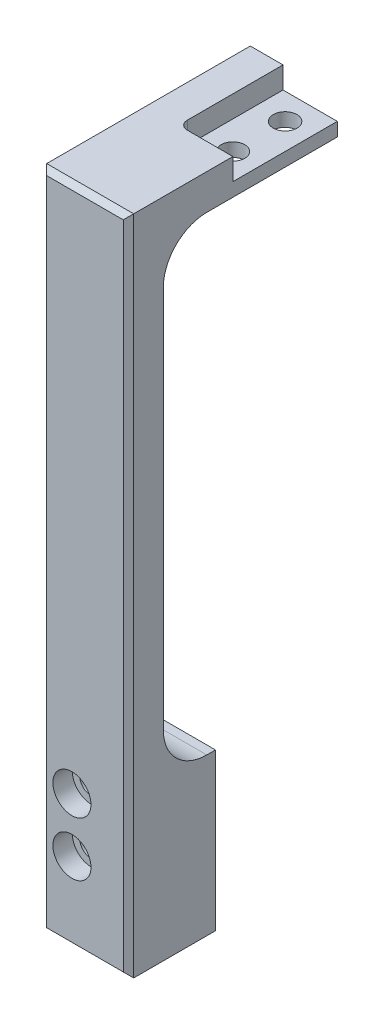
ISO-10303-21;
HEADER;
FILE_DESCRIPTION(('STEP AP214'),'2;1');
FILE_NAME('part.step','',(''),(''),'','','');
FILE_SCHEMA(('AUTOMOTIVE_DESIGN { 1 0 10303 214 1 1 1 1 }'));
ENDSEC;
DATA;
#1=APPLICATION_CONTEXT('core data for automotive mechanical design processes');
#2=APPLICATION_PROTOCOL_DEFINITION('international standard','automotive_design',2000,#1);
#3=PRODUCT_CONTEXT('',#1,'mechanical');
#4=PRODUCT('Part','Part','',(#3));
#5=PRODUCT_RELATED_PRODUCT_CATEGORY('part','',(#4));
#6=PRODUCT_DEFINITION_FORMATION('','',#4);
#7=PRODUCT_DEFINITION_CONTEXT('part definition',#1,'design');
#8=PRODUCT_DEFINITION('design','',#6,#7);
#9=PRODUCT_DEFINITION_SHAPE('','',#8);
#10=(LENGTH_UNIT() NAMED_UNIT(*) SI_UNIT(.MILLI.,.METRE.));
#11=(NAMED_UNIT(*) PLANE_ANGLE_UNIT() SI_UNIT($,.RADIAN.));
#12=(NAMED_UNIT(*) SI_UNIT($,.STERADIAN.) SOLID_ANGLE_UNIT());
#13=UNCERTAINTY_MEASURE_WITH_UNIT(LENGTH_MEASURE(1.E-05),#10,'distance_accuracy_value','');
#14=(GEOMETRIC_REPRESENTATION_CONTEXT(3) GLOBAL_UNCERTAINTY_ASSIGNED_CONTEXT((#13)) GLOBAL_UNIT_ASSIGNED_CONTEXT((#10,
#11,#12)) REPRESENTATION_CONTEXT('',''));
#15=CARTESIAN_POINT('',(0.,0.,0.));
#16=DIRECTION('',(0.,0.,1.));
#17=DIRECTION('',(1.,0.,0.));
#18=AXIS2_PLACEMENT_3D('',#15,#16,#17);
#19=CARTESIAN_POINT('',(8.89,0.,-13.97));
#20=DIRECTION('',(0.,1.,0.));
#21=DIRECTION('',(0.,0.,1.));
#22=AXIS2_PLACEMENT_3D('',#19,#20,#21);
#23=CYLINDRICAL_SURFACE('',#22,1.72719999999999);
#24=CARTESIAN_POINT('',(8.89,-5.1562,-13.97));
#25=DIRECTION('',(0.,1.,0.));
#26=DIRECTION('',(0.,0.,1.));
#27=AXIS2_PLACEMENT_3D('',#24,#25,#26);
#28=CIRCLE('',#27,1.72719999999999);
#29=CARTESIAN_POINT('',(8.89,-5.1562,-12.2428));
#30=VERTEX_POINT('',#29);
#31=EDGE_CURVE('E188',#30,#30,#28,.T.);
#32=ORIENTED_EDGE('',*,*,#31,.F.);
#33=EDGE_LOOP('',(#32));
#34=FACE_BOUND('',#33,.T.);
#35=CARTESIAN_POINT('',(8.89,-3.175,-13.97));
#36=DIRECTION('',(0.,1.,0.));
#37=DIRECTION('',(0.,0.,1.));
#38=AXIS2_PLACEMENT_3D('',#35,#36,#37);
#39=CIRCLE('',#38,1.72719999999999);
#40=CARTESIAN_POINT('',(8.89,-3.175,-12.2428));
#41=VERTEX_POINT('',#40);
#42=EDGE_CURVE('E184',#41,#41,#39,.F.);
#43=ORIENTED_EDGE('',*,*,#42,.F.);
#44=EDGE_LOOP('',(#43));
#45=FACE_BOUND('',#44,.T.);
#46=ADVANCED_FACE('F32',(#34,#45),#23,.F.);
#47=CARTESIAN_POINT('',(8.89,0.,-21.59));
#48=DIRECTION('',(0.,1.,0.));
#49=DIRECTION('',(0.,0.,1.));
#50=AXIS2_PLACEMENT_3D('',#47,#48,#49);
#51=CYLINDRICAL_SURFACE('',#50,1.72719999999999);
#52=CARTESIAN_POINT('',(8.89,-5.1562,-21.59));
#53=DIRECTION('',(0.,1.,0.));
#54=DIRECTION('',(0.,0.,1.));
#55=AXIS2_PLACEMENT_3D('',#52,#53,#54);
#56=CIRCLE('',#55,1.72719999999999);
#57=CARTESIAN_POINT('',(8.89,-5.1562,-19.8628));
#58=VERTEX_POINT('',#57);
#59=EDGE_CURVE('E187',#58,#58,#56,.T.);
#60=ORIENTED_EDGE('',*,*,#59,.F.);
#61=EDGE_LOOP('',(#60));
#62=FACE_BOUND('',#61,.T.);
#63=CARTESIAN_POINT('',(8.89,-3.175,-21.59));
#64=DIRECTION('',(0.,1.,0.));
#65=DIRECTION('',(0.,0.,1.));
#66=AXIS2_PLACEMENT_3D('',#63,#64,#65);
#67=CIRCLE('',#66,1.72719999999999);
#68=CARTESIAN_POINT('',(8.89,-3.175,-19.8628));
#69=VERTEX_POINT('',#68);
#70=EDGE_CURVE('E182',#69,#69,#67,.F.);
#71=ORIENTED_EDGE('',*,*,#70,.F.);
#72=EDGE_LOOP('',(#71));
#73=FACE_BOUND('',#72,.T.);
#74=ADVANCED_FACE('F380',(#62,#73),#51,.F.);
#75=CARTESIAN_POINT('',(0.,-96.5962,0.));
#76=DIRECTION('',(0.,0.,1.));
#77=DIRECTION('',(1.,0.,0.));
#78=AXIS2_PLACEMENT_3D('',#75,#76,#77);
#79=PLANE('',#78);
#80=DIRECTION('',(0.,1.,0.));
#81=VECTOR('',#80,1.);
#82=CARTESIAN_POINT('',(12.7,0.,0.));
#83=LINE('',#82,#81);
#84=CARTESIAN_POINT('',(12.7,-67.3862,0.));
#85=VERTEX_POINT('',#84);
#86=CARTESIAN_POINT('',(12.7,-11.5062,0.));
#87=VERTEX_POINT('',#86);
#88=EDGE_CURVE('E226',#85,#87,#83,.T.);
#89=ORIENTED_EDGE('',*,*,#88,.F.);
#90=DIRECTION('',(1.,0.,0.));
#91=VECTOR('',#90,1.);
#92=CARTESIAN_POINT('',(0.,-67.3862,0.));
#93=LINE('',#92,#91);
#94=CARTESIAN_POINT('',(0.,-67.3862,0.));
#95=VERTEX_POINT('',#94);
#96=EDGE_CURVE('E235',#85,#95,#93,.F.);
#97=ORIENTED_EDGE('',*,*,#96,.T.);
#98=DIRECTION('',(0.,-1.,0.));
#99=VECTOR('',#98,1.);
#100=CARTESIAN_POINT('',(0.,0.,0.));
#101=LINE('',#100,#99);
#102=CARTESIAN_POINT('',(0.,-11.5062,0.));
#103=VERTEX_POINT('',#102);
#104=EDGE_CURVE('E222',#103,#95,#101,.T.);
#105=ORIENTED_EDGE('',*,*,#104,.F.);
#106=DIRECTION('',(-1.,0.,0.));
#107=VECTOR('',#106,1.);
#108=CARTESIAN_POINT('',(12.7,-11.5062,0.));
#109=LINE('',#108,#107);
#110=EDGE_CURVE('E233',#103,#87,#109,.F.);
#111=ORIENTED_EDGE('',*,*,#110,.T.);
#112=EDGE_LOOP('',(#89,#97,#105,#111));
#113=FACE_BOUND('',#112,.T.);
#114=ADVANCED_FACE('F338',(#113),#79,.F.);
#115=CARTESIAN_POINT('',(0.,0.,5.08));
#116=DIRECTION('',(1.,0.,0.));
#117=DIRECTION('',(0.,1.,0.));
#118=AXIS2_PLACEMENT_3D('',#115,#116,#117);
#119=PLANE('',#118);
#120=DIRECTION('',(0.,0.,-1.));
#121=VECTOR('',#120,1.);
#122=CARTESIAN_POINT('',(0.,-96.5962,5.08));
#123=LINE('',#122,#121);
#124=CARTESIAN_POINT('',(0.,-96.5962,4.318));
#125=VERTEX_POINT('',#124);
#126=CARTESIAN_POINT('',(0.,-96.5962,-7.62));
#127=VERTEX_POINT('',#126);
#128=EDGE_CURVE('E297',#125,#127,#123,.T.);
#129=ORIENTED_EDGE('',*,*,#128,.F.);
#130=DIRECTION('',(0.,1.,0.));
#131=VECTOR('',#130,1.);
#132=CARTESIAN_POINT('',(0.,0.,4.318));
#133=LINE('',#132,#131);
#134=CARTESIAN_POINT('',(0.,0.,4.318));
#135=VERTEX_POINT('',#134);
#136=EDGE_CURVE('E257',#125,#135,#133,.T.);
#137=ORIENTED_EDGE('',*,*,#136,.T.);
#138=DIRECTION('',(0.,0.,-1.));
#139=VECTOR('',#138,1.);
#140=CARTESIAN_POINT('',(0.,0.,5.08));
#141=LINE('',#140,#139);
#142=CARTESIAN_POINT('',(0.,0.,-25.4));
#143=VERTEX_POINT('',#142);
#144=EDGE_CURVE('E232',#135,#143,#141,.T.);
#145=ORIENTED_EDGE('',*,*,#144,.T.);
#146=DIRECTION('',(0.,1.,0.));
#147=VECTOR('',#146,1.);
#148=CARTESIAN_POINT('',(0.,0.,-25.4));
#149=LINE('',#148,#147);
#150=CARTESIAN_POINT('',(0.,-5.1562,-25.4));
#151=VERTEX_POINT('',#150);
#152=EDGE_CURVE('E210',#151,#143,#149,.T.);
#153=ORIENTED_EDGE('',*,*,#152,.F.);
#154=DIRECTION('',(0.,0.,1.));
#155=VECTOR('',#154,1.);
#156=CARTESIAN_POINT('',(0.,-5.1562,-25.4));
#157=LINE('',#156,#155);
#158=CARTESIAN_POINT('',(0.,-5.1562,-6.35));
#159=VERTEX_POINT('',#158);
#160=EDGE_CURVE('E216',#151,#159,#157,.T.);
#161=ORIENTED_EDGE('',*,*,#160,.T.);
#162=CARTESIAN_POINT('',(0.,-11.5062,-6.35));
#163=DIRECTION('',(1.,0.,0.));
#164=DIRECTION('',(0.,1.,0.));
#165=AXIS2_PLACEMENT_3D('',#162,#163,#164);
#166=CIRCLE('',#165,6.35);
#167=EDGE_CURVE('E244',#159,#103,#166,.T.);
#168=ORIENTED_EDGE('',*,*,#167,.T.);
#169=ORIENTED_EDGE('',*,*,#104,.T.);
#170=CARTESIAN_POINT('',(0.,-67.3862,-6.35));
#171=DIRECTION('',(1.,0.,0.));
#172=DIRECTION('',(0.,1.,0.));
#173=AXIS2_PLACEMENT_3D('',#170,#171,#172);
#174=CIRCLE('',#173,6.35);
#175=CARTESIAN_POINT('',(0.,-73.7362,-6.35));
#176=VERTEX_POINT('',#175);
#177=EDGE_CURVE('E242',#95,#176,#174,.T.);
#178=ORIENTED_EDGE('',*,*,#177,.T.);
#179=DIRECTION('',(0.,0.,1.));
#180=VECTOR('',#179,1.);
#181=CARTESIAN_POINT('',(0.,-73.7362,-7.62));
#182=LINE('',#181,#180);
#183=CARTESIAN_POINT('',(0.,-73.7362,-7.62));
#184=VERTEX_POINT('',#183);
#185=EDGE_CURVE('E204',#184,#176,#182,.T.);
#186=ORIENTED_EDGE('',*,*,#185,.F.);
#187=DIRECTION('',(0.,1.,0.));
#188=VECTOR('',#187,1.);
#189=CARTESIAN_POINT('',(0.,-96.5962,-7.62));
#190=LINE('',#189,#188);
#191=EDGE_CURVE('E197',#127,#184,#190,.T.);
#192=ORIENTED_EDGE('',*,*,#191,.F.);
#193=EDGE_LOOP('',(#129,#137,#145,#153,#161,#168,#169,#178,#186,#192));
#194=FACE_BOUND('',#193,.T.);
#195=ADVANCED_FACE('F317',(#194),#119,.F.);
#196=CARTESIAN_POINT('',(0.,-96.5962,5.08));
#197=DIRECTION('',(0.,1.,0.));
#198=DIRECTION('',(0.,0.,1.));
#199=AXIS2_PLACEMENT_3D('',#196,#197,#198);
#200=PLANE('',#199);
#201=DIRECTION('',(0.,0.,-1.));
#202=VECTOR('',#201,1.);
#203=CARTESIAN_POINT('',(12.7,-96.5962,5.08));
#204=LINE('',#203,#202);
#205=CARTESIAN_POINT('',(12.7,-96.5962,4.318));
#206=VERTEX_POINT('',#205);
#207=CARTESIAN_POINT('',(12.7,-96.5962,-7.62));
#208=VERTEX_POINT('',#207);
#209=EDGE_CURVE('E311',#206,#208,#204,.T.);
#210=ORIENTED_EDGE('',*,*,#209,.F.);
#211=DIRECTION('',(-1.,0.,0.));
#212=VECTOR('',#211,1.);
#213=CARTESIAN_POINT('',(0.,-96.5962,4.318));
#214=LINE('',#213,#212);
#215=EDGE_CURVE('E260',#206,#125,#214,.T.);
#216=ORIENTED_EDGE('',*,*,#215,.T.);
#217=ORIENTED_EDGE('',*,*,#128,.T.);
#218=DIRECTION('',(-1.,0.,0.));
#219=VECTOR('',#218,1.);
#220=CARTESIAN_POINT('',(12.7,-96.5962,-7.62));
#221=LINE('',#220,#219);
#222=EDGE_CURVE('E194',#208,#127,#221,.T.);
#223=ORIENTED_EDGE('',*,*,#222,.F.);
#224=EDGE_LOOP('',(#210,#216,#217,#223));
#225=FACE_BOUND('',#224,.T.);
#226=ADVANCED_FACE('F411',(#225),#200,.F.);
#227=CARTESIAN_POINT('',(12.7,0.,5.08));
#228=DIRECTION('',(-1.,0.,0.));
#229=DIRECTION('',(0.,-1.,0.));
#230=AXIS2_PLACEMENT_3D('',#227,#228,#229);
#231=PLANE('',#230);
#232=DIRECTION('',(0.,0.,-1.));
#233=VECTOR('',#232,1.);
#234=CARTESIAN_POINT('',(12.7,0.,5.08));
#235=LINE('',#234,#233);
#236=CARTESIAN_POINT('',(12.7,0.,4.318));
#237=VERTEX_POINT('',#236);
#238=CARTESIAN_POINT('',(12.7,0.,-10.16));
#239=VERTEX_POINT('',#238);
#240=EDGE_CURVE('E313',#237,#239,#235,.T.);
#241=ORIENTED_EDGE('',*,*,#240,.F.);
#242=DIRECTION('',(0.,-1.,0.));
#243=VECTOR('',#242,1.);
#244=CARTESIAN_POINT('',(12.7,-96.5962,4.318));
#245=LINE('',#244,#243);
#246=EDGE_CURVE('E41',#237,#206,#245,.T.);
#247=ORIENTED_EDGE('',*,*,#246,.T.);
#248=ORIENTED_EDGE('',*,*,#209,.T.);
#249=DIRECTION('',(0.,-1.,0.));
#250=VECTOR('',#249,1.);
#251=CARTESIAN_POINT('',(12.7,-96.5962,-7.62));
#252=LINE('',#251,#250);
#253=CARTESIAN_POINT('',(12.7,-73.7362,-7.62));
#254=VERTEX_POINT('',#253);
#255=EDGE_CURVE('E191',#254,#208,#252,.T.);
#256=ORIENTED_EDGE('',*,*,#255,.F.);
#257=DIRECTION('',(0.,0.,1.));
#258=VECTOR('',#257,1.);
#259=CARTESIAN_POINT('',(12.7,-73.7362,-7.62));
#260=LINE('',#259,#258);
#261=CARTESIAN_POINT('',(12.7,-73.7362,-6.35));
#262=VERTEX_POINT('',#261);
#263=EDGE_CURVE('E201',#254,#262,#260,.T.);
#264=ORIENTED_EDGE('',*,*,#263,.T.);
#265=CARTESIAN_POINT('',(12.7,-67.3862,-6.35));
#266=DIRECTION('',(-1.,0.,0.));
#267=DIRECTION('',(0.,-1.,0.));
#268=AXIS2_PLACEMENT_3D('',#265,#266,#267);
#269=CIRCLE('',#268,6.35);
#270=EDGE_CURVE('E240',#262,#85,#269,.T.);
#271=ORIENTED_EDGE('',*,*,#270,.T.);
#272=ORIENTED_EDGE('',*,*,#88,.T.);
#273=CARTESIAN_POINT('',(12.7,-11.5062,-6.35));
#274=DIRECTION('',(-1.,0.,0.));
#275=DIRECTION('',(0.,-1.,0.));
#276=AXIS2_PLACEMENT_3D('',#273,#274,#275);
#277=CIRCLE('',#276,6.35);
#278=CARTESIAN_POINT('',(12.7,-5.1562,-6.35));
#279=VERTEX_POINT('',#278);
#280=EDGE_CURVE('E246',#87,#279,#277,.T.);
#281=ORIENTED_EDGE('',*,*,#280,.T.);
#282=DIRECTION('',(0.,0.,1.));
#283=VECTOR('',#282,1.);
#284=CARTESIAN_POINT('',(12.7,-5.1562,-25.4));
#285=LINE('',#284,#283);
#286=CARTESIAN_POINT('',(12.7,-5.1562,-25.4));
#287=VERTEX_POINT('',#286);
#288=EDGE_CURVE('E227',#287,#279,#285,.T.);
#289=ORIENTED_EDGE('',*,*,#288,.F.);
#290=DIRECTION('',(0.,-1.,0.));
#291=VECTOR('',#290,1.);
#292=CARTESIAN_POINT('',(12.7,0.,-25.4));
#293=LINE('',#292,#291);
#294=CARTESIAN_POINT('',(12.7,-3.175,-25.4));
#295=VERTEX_POINT('',#294);
#296=EDGE_CURVE('E172',#295,#287,#293,.T.);
#297=ORIENTED_EDGE('',*,*,#296,.F.);
#298=DIRECTION('',(0.,0.,-1.));
#299=VECTOR('',#298,1.);
#300=CARTESIAN_POINT('',(12.7,-3.175,-25.4));
#301=LINE('',#300,#299);
#302=CARTESIAN_POINT('',(12.7,-3.175,-10.16));
#303=VERTEX_POINT('',#302);
#304=EDGE_CURVE('E151',#303,#295,#301,.T.);
#305=ORIENTED_EDGE('',*,*,#304,.F.);
#306=DIRECTION('',(0.,1.,0.));
#307=VECTOR('',#306,1.);
#308=CARTESIAN_POINT('',(12.7,-3.175,-10.16));
#309=LINE('',#308,#307);
#310=EDGE_CURVE('E162',#303,#239,#309,.T.);
#311=ORIENTED_EDGE('',*,*,#310,.T.);
#312=EDGE_LOOP('',(#241,#247,#248,#256,#264,#271,#272,#281,#289,#297,#305,#311));
#313=FACE_BOUND('',#312,.T.);
#314=ADVANCED_FACE('F170',(#313),#231,.F.);
#315=CARTESIAN_POINT('',(0.,0.,5.08));
#316=DIRECTION('',(0.,-1.,0.));
#317=DIRECTION('',(0.,0.,-1.));
#318=AXIS2_PLACEMENT_3D('',#315,#316,#317);
#319=PLANE('',#318);
#320=ORIENTED_EDGE('',*,*,#144,.F.);
#321=DIRECTION('',(1.,0.,0.));
#322=VECTOR('',#321,1.);
#323=CARTESIAN_POINT('',(12.7,0.,4.318));
#324=LINE('',#323,#322);
#325=EDGE_CURVE('E11',#135,#237,#324,.T.);
#326=ORIENTED_EDGE('',*,*,#325,.T.);
#327=ORIENTED_EDGE('',*,*,#240,.T.);
#328=DIRECTION('',(1.,0.,0.));
#329=VECTOR('',#328,1.);
#330=CARTESIAN_POINT('',(4.7752,0.,-10.16));
#331=LINE('',#330,#329);
#332=CARTESIAN_POINT('',(6.0452,0.,-10.16));
#333=VERTEX_POINT('',#332);
#334=EDGE_CURVE('E165',#333,#239,#331,.T.);
#335=ORIENTED_EDGE('',*,*,#334,.F.);
#336=CARTESIAN_POINT('',(6.0452,0.,-11.43));
#337=DIRECTION('',(0.,-1.,0.));
#338=DIRECTION('',(0.,0.,-1.));
#339=AXIS2_PLACEMENT_3D('',#336,#337,#338);
#340=CIRCLE('',#339,1.27);
#341=CARTESIAN_POINT('',(4.7752,0.,-11.43));
#342=VERTEX_POINT('',#341);
#343=EDGE_CURVE('E292',#333,#342,#340,.T.);
#344=ORIENTED_EDGE('',*,*,#343,.T.);
#345=DIRECTION('',(0.,0.,1.));
#346=VECTOR('',#345,1.);
#347=CARTESIAN_POINT('',(4.7752,0.,-25.4));
#348=LINE('',#347,#346);
#349=CARTESIAN_POINT('',(4.7752,0.,-25.4));
#350=VERTEX_POINT('',#349);
#351=EDGE_CURVE('E177',#350,#342,#348,.T.);
#352=ORIENTED_EDGE('',*,*,#351,.F.);
#353=DIRECTION('',(1.,0.,0.));
#354=VECTOR('',#353,1.);
#355=CARTESIAN_POINT('',(12.7,0.,-25.4));
#356=LINE('',#355,#354);
#357=EDGE_CURVE('E213',#143,#350,#356,.T.);
#358=ORIENTED_EDGE('',*,*,#357,.F.);
#359=EDGE_LOOP('',(#320,#326,#327,#335,#344,#352,#358));
#360=FACE_BOUND('',#359,.T.);
#361=ADVANCED_FACE('F325',(#360),#319,.F.);
#362=CARTESIAN_POINT('',(0.,-96.5962,5.08));
#363=DIRECTION('',(0.,0.,1.));
#364=DIRECTION('',(1.,0.,0.));
#365=AXIS2_PLACEMENT_3D('',#362,#363,#364);
#366=PLANE('',#365);
#367=CARTESIAN_POINT('',(4.44500000000003,-84.963,5.08));
#368=DIRECTION('',(0.,0.,1.));
#369=DIRECTION('',(1.,0.,0.));
#370=AXIS2_PLACEMENT_3D('',#367,#368,#369);
#371=CIRCLE('',#370,2.77875999999999);
#372=CARTESIAN_POINT('',(7.22376000000003,-84.963,5.08));
#373=VERTEX_POINT('',#372);
#374=EDGE_CURVE('E642',#373,#373,#371,.T.);
#375=ORIENTED_EDGE('',*,*,#374,.F.);
#376=EDGE_LOOP('',(#375));
#377=FACE_BOUND('',#376,.T.);
#378=CARTESIAN_POINT('',(4.44500000000003,-77.0382,5.08));
#379=DIRECTION('',(0.,0.,1.));
#380=DIRECTION('',(1.,0.,0.));
#381=AXIS2_PLACEMENT_3D('',#378,#379,#380);
#382=CIRCLE('',#381,2.77875999999999);
#383=CARTESIAN_POINT('',(7.22376000000003,-77.0382,5.08));
#384=VERTEX_POINT('',#383);
#385=EDGE_CURVE('E282',#384,#384,#382,.T.);
#386=ORIENTED_EDGE('',*,*,#385,.F.);
#387=EDGE_LOOP('',(#386));
#388=FACE_BOUND('',#387,.T.);
#389=DIRECTION('',(-1.,0.,0.));
#390=VECTOR('',#389,1.);
#391=CARTESIAN_POINT('',(0.,-0.761999999999999,5.08));
#392=LINE('',#391,#390);
#393=CARTESIAN_POINT('',(11.938,-0.761999999999999,5.08));
#394=VERTEX_POINT('',#393);
#395=CARTESIAN_POINT('',(0.761999999999999,-0.761999999999999,5.08));
#396=VERTEX_POINT('',#395);
#397=EDGE_CURVE('E248',#394,#396,#392,.T.);
#398=ORIENTED_EDGE('',*,*,#397,.T.);
#399=DIRECTION('',(0.,-1.,0.));
#400=VECTOR('',#399,1.);
#401=CARTESIAN_POINT('',(0.762000000000011,-96.5962,5.08));
#402=LINE('',#401,#400);
#403=CARTESIAN_POINT('',(0.76200000000001,-95.8342,5.08));
#404=VERTEX_POINT('',#403);
#405=EDGE_CURVE('E254',#396,#404,#402,.T.);
#406=ORIENTED_EDGE('',*,*,#405,.T.);
#407=DIRECTION('',(1.,0.,0.));
#408=VECTOR('',#407,1.);
#409=CARTESIAN_POINT('',(12.7,-95.8342,5.08));
#410=LINE('',#409,#408);
#411=CARTESIAN_POINT('',(11.938,-95.8342,5.08));
#412=VERTEX_POINT('',#411);
#413=EDGE_CURVE('E252',#404,#412,#410,.T.);
#414=ORIENTED_EDGE('',*,*,#413,.T.);
#415=DIRECTION('',(0.,1.,0.));
#416=VECTOR('',#415,1.);
#417=CARTESIAN_POINT('',(11.938,0.,5.08));
#418=LINE('',#417,#416);
#419=EDGE_CURVE('E250',#412,#394,#418,.T.);
#420=ORIENTED_EDGE('',*,*,#419,.T.);
#421=EDGE_LOOP('',(#398,#406,#414,#420));
#422=FACE_BOUND('',#421,.T.);
#423=ADVANCED_FACE('F367',(#377,#388,#422),#366,.T.);
#424=CARTESIAN_POINT('',(12.7,-5.1562,-25.4));
#425=DIRECTION('',(0.,1.,0.));
#426=DIRECTION('',(0.,0.,1.));
#427=AXIS2_PLACEMENT_3D('',#424,#425,#426);
#428=PLANE('',#427);
#429=ORIENTED_EDGE('',*,*,#59,.T.);
#430=EDGE_LOOP('',(#429));
#431=FACE_BOUND('',#430,.T.);
#432=ORIENTED_EDGE('',*,*,#31,.T.);
#433=EDGE_LOOP('',(#432));
#434=FACE_BOUND('',#433,.T.);
#435=ORIENTED_EDGE('',*,*,#288,.T.);
#436=DIRECTION('',(-1.,0.,0.));
#437=VECTOR('',#436,1.);
#438=CARTESIAN_POINT('',(0.,-5.1562,-6.35));
#439=LINE('',#438,#437);
#440=EDGE_CURVE('E237',#279,#159,#439,.T.);
#441=ORIENTED_EDGE('',*,*,#440,.T.);
#442=ORIENTED_EDGE('',*,*,#160,.F.);
#443=DIRECTION('',(-1.,0.,0.));
#444=VECTOR('',#443,1.);
#445=CARTESIAN_POINT('',(12.7,-5.1562,-25.4));
#446=LINE('',#445,#444);
#447=EDGE_CURVE('E208',#287,#151,#446,.T.);
#448=ORIENTED_EDGE('',*,*,#447,.F.);
#449=EDGE_LOOP('',(#435,#441,#442,#448));
#450=FACE_BOUND('',#449,.T.);
#451=ADVANCED_FACE('F328',(#431,#434,#450),#428,.F.);
#452=CARTESIAN_POINT('',(12.7,-5.1562,-25.4));
#453=DIRECTION('',(0.,0.,-1.));
#454=DIRECTION('',(-1.,0.,0.));
#455=AXIS2_PLACEMENT_3D('',#452,#453,#454);
#456=PLANE('',#455);
#457=DIRECTION('',(0.,1.,0.));
#458=VECTOR('',#457,1.);
#459=CARTESIAN_POINT('',(4.7752,-3.175,-25.4));
#460=LINE('',#459,#458);
#461=CARTESIAN_POINT('',(4.7752,-3.175,-25.4));
#462=VERTEX_POINT('',#461);
#463=EDGE_CURVE('E166',#462,#350,#460,.T.);
#464=ORIENTED_EDGE('',*,*,#463,.F.);
#465=DIRECTION('',(-1.,0.,0.));
#466=VECTOR('',#465,1.);
#467=CARTESIAN_POINT('',(4.7752,-3.175,-25.4));
#468=LINE('',#467,#466);
#469=EDGE_CURVE('E167',#295,#462,#468,.T.);
#470=ORIENTED_EDGE('',*,*,#469,.F.);
#471=ORIENTED_EDGE('',*,*,#296,.T.);
#472=ORIENTED_EDGE('',*,*,#447,.T.);
#473=ORIENTED_EDGE('',*,*,#152,.T.);
#474=ORIENTED_EDGE('',*,*,#357,.T.);
#475=EDGE_LOOP('',(#464,#470,#471,#472,#473,#474));
#476=FACE_BOUND('',#475,.T.);
#477=ADVANCED_FACE('F321',(#476),#456,.T.);
#478=CARTESIAN_POINT('',(12.7,-73.7362,-7.62));
#479=DIRECTION('',(0.,-1.,0.));
#480=DIRECTION('',(0.,0.,-1.));
#481=AXIS2_PLACEMENT_3D('',#478,#479,#480);
#482=PLANE('',#481);
#483=ORIENTED_EDGE('',*,*,#185,.T.);
#484=DIRECTION('',(1.,0.,0.));
#485=VECTOR('',#484,1.);
#486=CARTESIAN_POINT('',(12.7,-73.7362,-6.35));
#487=LINE('',#486,#485);
#488=EDGE_CURVE('E228',#176,#262,#487,.T.);
#489=ORIENTED_EDGE('',*,*,#488,.T.);
#490=ORIENTED_EDGE('',*,*,#263,.F.);
#491=DIRECTION('',(1.,0.,0.));
#492=VECTOR('',#491,1.);
#493=CARTESIAN_POINT('',(12.7,-73.7362,-7.62));
#494=LINE('',#493,#492);
#495=EDGE_CURVE('E199',#184,#254,#494,.T.);
#496=ORIENTED_EDGE('',*,*,#495,.F.);
#497=EDGE_LOOP('',(#483,#489,#490,#496));
#498=FACE_BOUND('',#497,.T.);
#499=ADVANCED_FACE('F348',(#498),#482,.F.);
#500=CARTESIAN_POINT('',(12.7,-73.7362,-7.62));
#501=DIRECTION('',(0.,0.,1.));
#502=DIRECTION('',(1.,0.,0.));
#503=AXIS2_PLACEMENT_3D('',#500,#501,#502);
#504=PLANE('',#503);
#505=CARTESIAN_POINT('',(4.44500000000003,-84.963,-7.62));
#506=DIRECTION('',(0.,0.,1.));
#507=DIRECTION('',(1.,0.,0.));
#508=AXIS2_PLACEMENT_3D('',#505,#506,#507);
#509=CIRCLE('',#508,1.7272);
#510=CARTESIAN_POINT('',(6.17220000000003,-84.963,-7.62));
#511=VERTEX_POINT('',#510);
#512=EDGE_CURVE('E36',#511,#511,#509,.T.);
#513=ORIENTED_EDGE('',*,*,#512,.T.);
#514=EDGE_LOOP('',(#513));
#515=FACE_BOUND('',#514,.T.);
#516=CARTESIAN_POINT('',(4.44500000000003,-77.0382,-7.62));
#517=DIRECTION('',(0.,0.,1.));
#518=DIRECTION('',(1.,0.,0.));
#519=AXIS2_PLACEMENT_3D('',#516,#517,#518);
#520=CIRCLE('',#519,1.7272);
#521=CARTESIAN_POINT('',(6.17220000000003,-77.0382,-7.62));
#522=VERTEX_POINT('',#521);
#523=EDGE_CURVE('E266',#522,#522,#520,.T.);
#524=ORIENTED_EDGE('',*,*,#523,.T.);
#525=EDGE_LOOP('',(#524));
#526=FACE_BOUND('',#525,.T.);
#527=ORIENTED_EDGE('',*,*,#255,.T.);
#528=ORIENTED_EDGE('',*,*,#222,.T.);
#529=ORIENTED_EDGE('',*,*,#191,.T.);
#530=ORIENTED_EDGE('',*,*,#495,.T.);
#531=EDGE_LOOP('',(#527,#528,#529,#530));
#532=FACE_BOUND('',#531,.T.);
#533=ADVANCED_FACE('F352',(#515,#526,#532),#504,.F.);
#534=CARTESIAN_POINT('',(4.7752,-3.175,-10.16));
#535=DIRECTION('',(0.,1.,0.));
#536=DIRECTION('',(0.,0.,1.));
#537=AXIS2_PLACEMENT_3D('',#534,#535,#536);
#538=PLANE('',#537);
#539=ORIENTED_EDGE('',*,*,#70,.T.);
#540=EDGE_LOOP('',(#539));
#541=FACE_BOUND('',#540,.T.);
#542=DIRECTION('',(0.,0.,1.));
#543=VECTOR('',#542,1.);
#544=CARTESIAN_POINT('',(4.7752,-3.175,-25.4));
#545=LINE('',#544,#543);
#546=CARTESIAN_POINT('',(4.7752,-3.175,-11.43));
#547=VERTEX_POINT('',#546);
#548=EDGE_CURVE('E158',#462,#547,#545,.T.);
#549=ORIENTED_EDGE('',*,*,#548,.T.);
#550=CARTESIAN_POINT('',(6.0452,-3.175,-11.43));
#551=DIRECTION('',(0.,1.,0.));
#552=DIRECTION('',(0.,0.,1.));
#553=AXIS2_PLACEMENT_3D('',#550,#551,#552);
#554=CIRCLE('',#553,1.27);
#555=CARTESIAN_POINT('',(6.0452,-3.175,-10.16));
#556=VERTEX_POINT('',#555);
#557=EDGE_CURVE('E154',#547,#556,#554,.T.);
#558=ORIENTED_EDGE('',*,*,#557,.T.);
#559=DIRECTION('',(1.,0.,0.));
#560=VECTOR('',#559,1.);
#561=CARTESIAN_POINT('',(4.7752,-3.175,-10.16));
#562=LINE('',#561,#560);
#563=EDGE_CURVE('E144',#556,#303,#562,.T.);
#564=ORIENTED_EDGE('',*,*,#563,.T.);
#565=ORIENTED_EDGE('',*,*,#304,.T.);
#566=ORIENTED_EDGE('',*,*,#469,.T.);
#567=EDGE_LOOP('',(#549,#558,#564,#565,#566));
#568=FACE_BOUND('',#567,.T.);
#569=ORIENTED_EDGE('',*,*,#42,.T.);
#570=EDGE_LOOP('',(#569));
#571=FACE_BOUND('',#570,.T.);
#572=ADVANCED_FACE('F147',(#541,#568,#571),#538,.T.);
#573=CARTESIAN_POINT('',(4.7752,-3.175,-25.4));
#574=DIRECTION('',(-1.,0.,0.));
#575=DIRECTION('',(0.,0.,1.));
#576=AXIS2_PLACEMENT_3D('',#573,#574,#575);
#577=PLANE('',#576);
#578=ORIENTED_EDGE('',*,*,#351,.T.);
#579=DIRECTION('',(0.,1.,0.));
#580=VECTOR('',#579,1.);
#581=CARTESIAN_POINT('',(4.7752,-3.175,-11.43));
#582=LINE('',#581,#580);
#583=EDGE_CURVE('E290',#342,#547,#582,.F.);
#584=ORIENTED_EDGE('',*,*,#583,.T.);
#585=ORIENTED_EDGE('',*,*,#548,.F.);
#586=ORIENTED_EDGE('',*,*,#463,.T.);
#587=EDGE_LOOP('',(#578,#584,#585,#586));
#588=FACE_BOUND('',#587,.T.);
#589=ADVANCED_FACE('F326',(#588),#577,.F.);
#590=CARTESIAN_POINT('',(4.7752,-3.175,-10.16));
#591=DIRECTION('',(0.,0.,1.));
#592=DIRECTION('',(1.,0.,0.));
#593=AXIS2_PLACEMENT_3D('',#590,#591,#592);
#594=PLANE('',#593);
#595=ORIENTED_EDGE('',*,*,#563,.F.);
#596=DIRECTION('',(0.,1.,0.));
#597=VECTOR('',#596,1.);
#598=CARTESIAN_POINT('',(6.0452,0.,-10.16));
#599=LINE('',#598,#597);
#600=EDGE_CURVE('E291',#556,#333,#599,.T.);
#601=ORIENTED_EDGE('',*,*,#600,.T.);
#602=ORIENTED_EDGE('',*,*,#334,.T.);
#603=ORIENTED_EDGE('',*,*,#310,.F.);
#604=EDGE_LOOP('',(#595,#601,#602,#603));
#605=FACE_BOUND('',#604,.T.);
#606=ADVANCED_FACE('F163',(#605),#594,.F.);
#607=CARTESIAN_POINT('',(6.0452,-3.175,-11.43));
#608=DIRECTION('',(0.,-1.,0.));
#609=DIRECTION('',(0.,0.,-1.));
#610=AXIS2_PLACEMENT_3D('',#607,#608,#609);
#611=CYLINDRICAL_SURFACE('',#610,1.27);
#612=ORIENTED_EDGE('',*,*,#557,.F.);
#613=ORIENTED_EDGE('',*,*,#583,.F.);
#614=ORIENTED_EDGE('',*,*,#343,.F.);
#615=ORIENTED_EDGE('',*,*,#600,.F.);
#616=EDGE_LOOP('',(#612,#613,#614,#615));
#617=FACE_BOUND('',#616,.T.);
#618=ADVANCED_FACE('F289',(#617),#611,.F.);
#619=CARTESIAN_POINT('',(12.7,-67.3862,-6.35));
#620=DIRECTION('',(-1.,0.,0.));
#621=DIRECTION('',(0.,0.,1.));
#622=AXIS2_PLACEMENT_3D('',#619,#620,#621);
#623=CYLINDRICAL_SURFACE('',#622,6.35);
#624=ORIENTED_EDGE('',*,*,#177,.F.);
#625=ORIENTED_EDGE('',*,*,#96,.F.);
#626=ORIENTED_EDGE('',*,*,#270,.F.);
#627=ORIENTED_EDGE('',*,*,#488,.F.);
#628=EDGE_LOOP('',(#624,#625,#626,#627));
#629=FACE_BOUND('',#628,.T.);
#630=ADVANCED_FACE('F341',(#629),#623,.F.);
#631=CARTESIAN_POINT('',(12.7,-11.5062,-6.35));
#632=DIRECTION('',(1.,0.,0.));
#633=DIRECTION('',(0.,0.,-1.));
#634=AXIS2_PLACEMENT_3D('',#631,#632,#633);
#635=CYLINDRICAL_SURFACE('',#634,6.35);
#636=ORIENTED_EDGE('',*,*,#280,.F.);
#637=ORIENTED_EDGE('',*,*,#110,.F.);
#638=ORIENTED_EDGE('',*,*,#167,.F.);
#639=ORIENTED_EDGE('',*,*,#440,.F.);
#640=EDGE_LOOP('',(#636,#637,#638,#639));
#641=FACE_BOUND('',#640,.T.);
#642=ADVANCED_FACE('F334',(#641),#635,.F.);
#643=CARTESIAN_POINT('',(11.938,-96.5962,5.08));
#644=DIRECTION('',(0.707106781186548,0.,0.707106781186548));
#645=DIRECTION('',(0.707106781186548,0.,-0.707106781186548));
#646=AXIS2_PLACEMENT_3D('',#643,#644,#645);
#647=PLANE('',#646);
#648=DIRECTION('',(0.577350269189626,-0.577350269189626,-0.577350269189626));
#649=VECTOR('',#648,1.);
#650=CARTESIAN_POINT('',(12.192,-96.0882,4.826));
#651=LINE('',#650,#649);
#652=EDGE_CURVE('E268',#206,#412,#651,.F.);
#653=ORIENTED_EDGE('',*,*,#652,.F.);
#654=ORIENTED_EDGE('',*,*,#246,.F.);
#655=DIRECTION('',(0.577350269189626,0.577350269189626,-0.577350269189626));
#656=VECTOR('',#655,1.);
#657=CARTESIAN_POINT('',(7.95866666666667,-4.74133333333333,9.05933333333333));
#658=LINE('',#657,#656);
#659=EDGE_CURVE('E180',#394,#237,#658,.T.);
#660=ORIENTED_EDGE('',*,*,#659,.F.);
#661=ORIENTED_EDGE('',*,*,#419,.F.);
#662=EDGE_LOOP('',(#653,#654,#660,#661));
#663=FACE_BOUND('',#662,.T.);
#664=ADVANCED_FACE('F34',(#663),#647,.T.);
#665=CARTESIAN_POINT('',(0.,-0.761999999999999,5.08));
#666=DIRECTION('',(0.,0.707106781186548,0.707106781186548));
#667=DIRECTION('',(0.,-0.707106781186548,0.707106781186548));
#668=AXIS2_PLACEMENT_3D('',#665,#666,#667);
#669=PLANE('',#668);
#670=ORIENTED_EDGE('',*,*,#659,.T.);
#671=ORIENTED_EDGE('',*,*,#325,.F.);
#672=DIRECTION('',(0.577350269189626,-0.577350269189626,0.577350269189626));
#673=VECTOR('',#672,1.);
#674=CARTESIAN_POINT('',(0.508000000000003,-0.508000000000003,4.826));
#675=LINE('',#674,#673);
#676=EDGE_CURVE('E265',#396,#135,#675,.F.);
#677=ORIENTED_EDGE('',*,*,#676,.F.);
#678=ORIENTED_EDGE('',*,*,#397,.F.);
#679=EDGE_LOOP('',(#670,#671,#677,#678));
#680=FACE_BOUND('',#679,.T.);
#681=ADVANCED_FACE('F371',(#680),#669,.T.);
#682=CARTESIAN_POINT('',(0.,-95.8342,5.08));
#683=DIRECTION('',(0.,-0.707106781186548,0.707106781186548));
#684=DIRECTION('',(0.,-0.707106781186548,-0.707106781186548));
#685=AXIS2_PLACEMENT_3D('',#682,#683,#684);
#686=PLANE('',#685);
#687=ORIENTED_EDGE('',*,*,#652,.T.);
#688=ORIENTED_EDGE('',*,*,#413,.F.);
#689=DIRECTION('',(-0.577350269189626,-0.577350269189626,-0.577350269189626));
#690=VECTOR('',#689,1.);
#691=CARTESIAN_POINT('',(0.508000000000011,-96.0882,4.826));
#692=LINE('',#691,#690);
#693=EDGE_CURVE('E263',#125,#404,#692,.F.);
#694=ORIENTED_EDGE('',*,*,#693,.F.);
#695=ORIENTED_EDGE('',*,*,#215,.F.);
#696=EDGE_LOOP('',(#687,#688,#694,#695));
#697=FACE_BOUND('',#696,.T.);
#698=ADVANCED_FACE('F363',(#697),#686,.T.);
#699=CARTESIAN_POINT('',(0.762000000000011,-96.5962,5.08));
#700=DIRECTION('',(-0.707106781186548,0.,0.707106781186548));
#701=DIRECTION('',(0.707106781186548,0.,0.707106781186548));
#702=AXIS2_PLACEMENT_3D('',#699,#700,#701);
#703=PLANE('',#702);
#704=ORIENTED_EDGE('',*,*,#676,.T.);
#705=ORIENTED_EDGE('',*,*,#136,.F.);
#706=ORIENTED_EDGE('',*,*,#693,.T.);
#707=ORIENTED_EDGE('',*,*,#405,.F.);
#708=EDGE_LOOP('',(#704,#705,#706,#707));
#709=FACE_BOUND('',#708,.T.);
#710=ADVANCED_FACE('F357',(#709),#703,.T.);
#711=CARTESIAN_POINT('',(4.44500000000003,-77.0382,5.08));
#712=DIRECTION('',(0.,0.,1.));
#713=DIRECTION('',(1.,0.,0.));
#714=AXIS2_PLACEMENT_3D('',#711,#712,#713);
#715=CYLINDRICAL_SURFACE('',#714,1.7272);
#716=CARTESIAN_POINT('',(4.44500000000003,-77.0382,2.2352));
#717=DIRECTION('',(0.,0.,1.));
#718=DIRECTION('',(1.,0.,0.));
#719=AXIS2_PLACEMENT_3D('',#716,#717,#718);
#720=CIRCLE('',#719,1.7272);
#721=CARTESIAN_POINT('',(6.17220000000003,-77.0382,2.2352));
#722=VERTEX_POINT('',#721);
#723=EDGE_CURVE('E273',#722,#722,#720,.T.);
#724=ORIENTED_EDGE('',*,*,#723,.T.);
#725=EDGE_LOOP('',(#724));
#726=FACE_BOUND('',#725,.T.);
#727=ORIENTED_EDGE('',*,*,#523,.F.);
#728=EDGE_LOOP('',(#727));
#729=FACE_BOUND('',#728,.T.);
#730=ADVANCED_FACE('F422',(#726,#729),#715,.F.);
#731=CARTESIAN_POINT('',(6.17220000000003,-77.0382,2.2352));
#732=DIRECTION('',(0.,0.,-1.));
#733=DIRECTION('',(-1.,0.,0.));
#734=AXIS2_PLACEMENT_3D('',#731,#732,#733);
#735=PLANE('',#734);
#736=ORIENTED_EDGE('',*,*,#723,.F.);
#737=EDGE_LOOP('',(#736));
#738=FACE_BOUND('',#737,.T.);
#739=CARTESIAN_POINT('',(4.44500000000003,-77.0382,2.2352));
#740=DIRECTION('',(0.,0.,1.));
#741=DIRECTION('',(1.,0.,0.));
#742=AXIS2_PLACEMENT_3D('',#739,#740,#741);
#743=CIRCLE('',#742,2.77876);
#744=CARTESIAN_POINT('',(7.22376000000003,-77.0382,2.2352));
#745=VERTEX_POINT('',#744);
#746=EDGE_CURVE('E277',#745,#745,#743,.T.);
#747=ORIENTED_EDGE('',*,*,#746,.T.);
#748=EDGE_LOOP('',(#747));
#749=FACE_BOUND('',#748,.T.);
#750=ADVANCED_FACE('F439',(#738,#749),#735,.F.);
#751=CARTESIAN_POINT('',(4.44500000000003,-77.0382,5.08));
#752=DIRECTION('',(0.,0.,1.));
#753=DIRECTION('',(1.,0.,0.));
#754=AXIS2_PLACEMENT_3D('',#751,#752,#753);
#755=CYLINDRICAL_SURFACE('',#754,2.77876);
#756=ORIENTED_EDGE('',*,*,#746,.F.);
#757=EDGE_LOOP('',(#756));
#758=FACE_BOUND('',#757,.T.);
#759=ORIENTED_EDGE('',*,*,#385,.T.);
#760=EDGE_LOOP('',(#759));
#761=FACE_BOUND('',#760,.T.);
#762=ADVANCED_FACE('F447',(#758,#761),#755,.F.);
#763=CARTESIAN_POINT('',(4.44500000000003,-84.963,5.08));
#764=DIRECTION('',(0.,0.,1.));
#765=DIRECTION('',(1.,0.,0.));
#766=AXIS2_PLACEMENT_3D('',#763,#764,#765);
#767=CYLINDRICAL_SURFACE('',#766,1.7272);
#768=CARTESIAN_POINT('',(4.44500000000003,-84.963,2.2352));
#769=DIRECTION('',(0.,0.,1.));
#770=DIRECTION('',(1.,0.,0.));
#771=AXIS2_PLACEMENT_3D('',#768,#769,#770);
#772=CIRCLE('',#771,1.7272);
#773=CARTESIAN_POINT('',(6.17220000000003,-84.963,2.2352));
#774=VERTEX_POINT('',#773);
#775=EDGE_CURVE('E644',#774,#774,#772,.T.);
#776=ORIENTED_EDGE('',*,*,#775,.T.);
#777=EDGE_LOOP('',(#776));
#778=FACE_BOUND('',#777,.T.);
#779=ORIENTED_EDGE('',*,*,#512,.F.);
#780=EDGE_LOOP('',(#779));
#781=FACE_BOUND('',#780,.T.);
#782=ADVANCED_FACE('F455',(#778,#781),#767,.F.);
#783=CARTESIAN_POINT('',(6.17220000000003,-84.963,2.2352));
#784=DIRECTION('',(0.,0.,-1.));
#785=DIRECTION('',(-1.,0.,0.));
#786=AXIS2_PLACEMENT_3D('',#783,#784,#785);
#787=PLANE('',#786);
#788=ORIENTED_EDGE('',*,*,#775,.F.);
#789=EDGE_LOOP('',(#788));
#790=FACE_BOUND('',#789,.T.);
#791=CARTESIAN_POINT('',(4.44500000000003,-84.963,2.2352));
#792=DIRECTION('',(0.,0.,1.));
#793=DIRECTION('',(1.,0.,0.));
#794=AXIS2_PLACEMENT_3D('',#791,#792,#793);
#795=CIRCLE('',#794,2.77876);
#796=CARTESIAN_POINT('',(7.22376000000003,-84.963,2.2352));
#797=VERTEX_POINT('',#796);
#798=EDGE_CURVE('E639',#797,#797,#795,.T.);
#799=ORIENTED_EDGE('',*,*,#798,.T.);
#800=EDGE_LOOP('',(#799));
#801=FACE_BOUND('',#800,.T.);
#802=ADVANCED_FACE('F463',(#790,#801),#787,.F.);
#803=CARTESIAN_POINT('',(4.44500000000003,-84.963,5.08));
#804=DIRECTION('',(0.,0.,1.));
#805=DIRECTION('',(1.,0.,0.));
#806=AXIS2_PLACEMENT_3D('',#803,#804,#805);
#807=CYLINDRICAL_SURFACE('',#806,2.77876);
#808=ORIENTED_EDGE('',*,*,#798,.F.);
#809=EDGE_LOOP('',(#808));
#810=FACE_BOUND('',#809,.T.);
#811=ORIENTED_EDGE('',*,*,#374,.T.);
#812=EDGE_LOOP('',(#811));
#813=FACE_BOUND('',#812,.T.);
#814=ADVANCED_FACE('F471',(#810,#813),#807,.F.);
#815=CLOSED_SHELL('',(#46,#74,#114,#195,#226,#314,#361,#423,#451,#477,#499,#533,#572,#589,#606,
#618,#630,#642,#664,#681,#698,#710,#730,#750,#762,#782,#802,#814));
#816=MANIFOLD_SOLID_BREP('B2',#815);
#817=ADVANCED_BREP_SHAPE_REPRESENTATION('',(#18,#816),#14);
#818=SHAPE_DEFINITION_REPRESENTATION(#9,#817);
ENDSEC;
END-ISO-10303-21;
